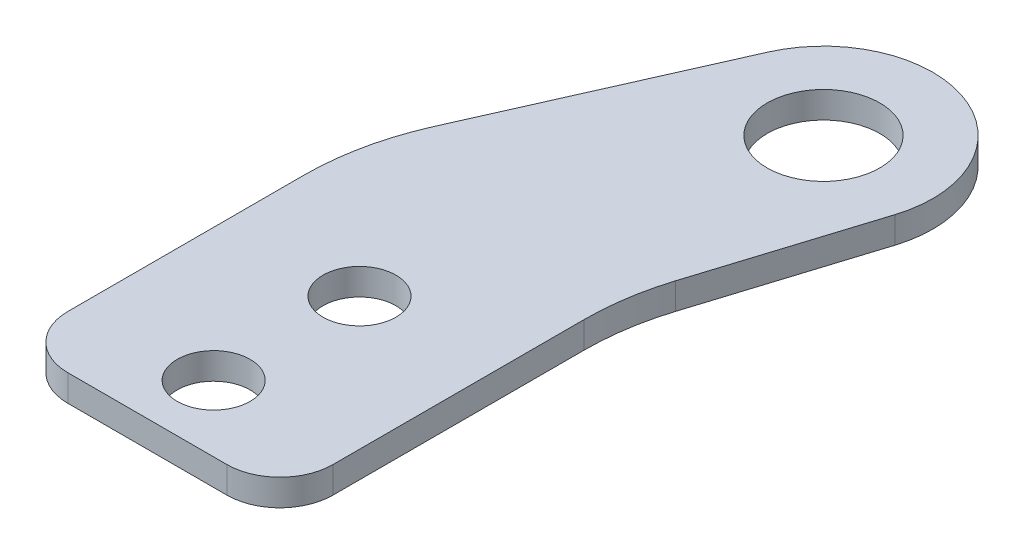
ISO-10303-21;
HEADER;
FILE_DESCRIPTION(('STEP AP214'),'2;1');
FILE_NAME('part.step','',(''),(''),'','','');
FILE_SCHEMA(('AUTOMOTIVE_DESIGN { 1 0 10303 214 1 1 1 1 }'));
ENDSEC;
DATA;
#1=APPLICATION_CONTEXT('core data for automotive mechanical design processes');
#2=APPLICATION_PROTOCOL_DEFINITION('international standard','automotive_design',2000,#1);
#3=PRODUCT_CONTEXT('',#1,'mechanical');
#4=PRODUCT('Part','Part','',(#3));
#5=PRODUCT_RELATED_PRODUCT_CATEGORY('part','',(#4));
#6=PRODUCT_DEFINITION_FORMATION('','',#4);
#7=PRODUCT_DEFINITION_CONTEXT('part definition',#1,'design');
#8=PRODUCT_DEFINITION('design','',#6,#7);
#9=PRODUCT_DEFINITION_SHAPE('','',#8);
#10=(LENGTH_UNIT() NAMED_UNIT(*) SI_UNIT(.MILLI.,.METRE.));
#11=(NAMED_UNIT(*) PLANE_ANGLE_UNIT() SI_UNIT($,.RADIAN.));
#12=(NAMED_UNIT(*) SI_UNIT($,.STERADIAN.) SOLID_ANGLE_UNIT());
#13=UNCERTAINTY_MEASURE_WITH_UNIT(LENGTH_MEASURE(1.E-05),#10,'distance_accuracy_value','');
#14=(GEOMETRIC_REPRESENTATION_CONTEXT(3) GLOBAL_UNCERTAINTY_ASSIGNED_CONTEXT((#13)) GLOBAL_UNIT_ASSIGNED_CONTEXT((#10,
#11,#12)) REPRESENTATION_CONTEXT('',''));
#15=CARTESIAN_POINT('',(0.,0.,0.));
#16=DIRECTION('',(0.,0.,1.));
#17=DIRECTION('',(1.,0.,0.));
#18=AXIS2_PLACEMENT_3D('',#15,#16,#17);
#19=CARTESIAN_POINT('',(-10.,-2.,0.));
#20=DIRECTION('',(-1.,0.,0.));
#21=DIRECTION('',(0.,0.,1.));
#22=AXIS2_PLACEMENT_3D('',#19,#20,#21);
#23=PLANE('',#22);
#24=DIRECTION('',(0.,0.,1.));
#25=VECTOR('',#24,1.);
#26=CARTESIAN_POINT('',(-10.,-2.,0.));
#27=LINE('',#26,#25);
#28=CARTESIAN_POINT('',(-10.,-2.,-21.767210757584));
#29=VERTEX_POINT('',#28);
#30=CARTESIAN_POINT('',(-10.,-2.,-4.));
#31=VERTEX_POINT('',#30);
#32=EDGE_CURVE('E156',#29,#31,#27,.T.);
#33=ORIENTED_EDGE('',*,*,#32,.T.);
#34=DIRECTION('',(0.,1.,0.));
#35=VECTOR('',#34,1.);
#36=CARTESIAN_POINT('',(-10.,-2.,-4.));
#37=LINE('',#36,#35);
#38=CARTESIAN_POINT('',(-10.,0.,-4.));
#39=VERTEX_POINT('',#38);
#40=EDGE_CURVE('E175',#31,#39,#37,.T.);
#41=ORIENTED_EDGE('',*,*,#40,.T.);
#42=DIRECTION('',(0.,0.,1.));
#43=VECTOR('',#42,1.);
#44=CARTESIAN_POINT('',(-10.,0.,0.));
#45=LINE('',#44,#43);
#46=CARTESIAN_POINT('',(-10.,0.,-21.767210757584));
#47=VERTEX_POINT('',#46);
#48=EDGE_CURVE('E141',#47,#39,#45,.T.);
#49=ORIENTED_EDGE('',*,*,#48,.F.);
#50=DIRECTION('',(0.,1.,0.));
#51=VECTOR('',#50,1.);
#52=CARTESIAN_POINT('',(-10.,-2.,-21.767210757584));
#53=LINE('',#52,#51);
#54=EDGE_CURVE('E163',#47,#29,#53,.F.);
#55=ORIENTED_EDGE('',*,*,#54,.T.);
#56=EDGE_LOOP('',(#33,#41,#49,#55));
#57=FACE_BOUND('',#56,.T.);
#58=ADVANCED_FACE('F35',(#57),#23,.T.);
#59=CARTESIAN_POINT('',(-10.,-2.,-26.));
#60=DIRECTION('',(-0.914257969875862,0.,-0.40513252710498));
#61=DIRECTION('',(-0.40513252710498,0.,0.914257969875862));
#62=AXIS2_PLACEMENT_3D('',#59,#60,#61);
#63=PLANE('',#62);
#64=DIRECTION('',(-0.40513252710498,0.,0.914257969875862));
#65=VECTOR('',#64,1.);
#66=CARTESIAN_POINT('',(-10.,-2.,-26.));
#67=LINE('',#66,#65);
#68=CARTESIAN_POINT('',(-0.542628251475869,-2.,-47.3423433486161));
#69=VERTEX_POINT('',#68);
#70=CARTESIAN_POINT('',(-8.28515939751724,-2.,-29.8698612996836));
#71=VERTEX_POINT('',#70);
#72=EDGE_CURVE('E133',#69,#71,#67,.T.);
#73=ORIENTED_EDGE('',*,*,#72,.T.);
#74=DIRECTION('',(0.,1.,0.));
#75=VECTOR('',#74,1.);
#76=CARTESIAN_POINT('',(-8.28515939751724,-2.,-29.8698612996836));
#77=LINE('',#76,#75);
#78=CARTESIAN_POINT('',(-8.28515939751724,0.,-29.8698612996836));
#79=VERTEX_POINT('',#78);
#80=EDGE_CURVE('E157',#71,#79,#77,.T.);
#81=ORIENTED_EDGE('',*,*,#80,.T.);
#82=DIRECTION('',(-0.40513252710498,0.,0.914257969875862));
#83=VECTOR('',#82,1.);
#84=CARTESIAN_POINT('',(-10.,0.,-26.));
#85=LINE('',#84,#83);
#86=CARTESIAN_POINT('',(-0.542628251475869,0.,-47.3423433486161));
#87=VERTEX_POINT('',#86);
#88=EDGE_CURVE('E153',#87,#79,#85,.T.);
#89=ORIENTED_EDGE('',*,*,#88,.F.);
#90=DIRECTION('',(0.,1.,0.));
#91=VECTOR('',#90,1.);
#92=CARTESIAN_POINT('',(-0.542628251475869,-2.,-47.3423433486161));
#93=LINE('',#92,#91);
#94=EDGE_CURVE('E132',#69,#87,#93,.T.);
#95=ORIENTED_EDGE('',*,*,#94,.F.);
#96=EDGE_LOOP('',(#73,#81,#89,#95));
#97=FACE_BOUND('',#96,.T.);
#98=ADVANCED_FACE('F214',(#97),#63,.T.);
#99=CARTESIAN_POINT('',(6.99999999999999,-2.,-44.));
#100=DIRECTION('',(0.,1.,0.));
#101=DIRECTION('',(0.,0.,1.));
#102=AXIS2_PLACEMENT_3D('',#99,#100,#101);
#103=CYLINDRICAL_SURFACE('',#102,8.25);
#104=CARTESIAN_POINT('',(6.99999999999999,0.,-44.));
#105=DIRECTION('',(0.,1.,0.));
#106=DIRECTION('',(0.,0.,-1.));
#107=AXIS2_PLACEMENT_3D('',#104,#105,#106);
#108=CIRCLE('',#107,8.25);
#109=CARTESIAN_POINT('',(14.8717936047529,0.,-41.5307156007921));
#110=VERTEX_POINT('',#109);
#111=EDGE_CURVE('E131',#110,#87,#108,.T.);
#112=ORIENTED_EDGE('',*,*,#111,.F.);
#113=DIRECTION('',(0.,1.,0.));
#114=VECTOR('',#113,1.);
#115=CARTESIAN_POINT('',(14.8717936047529,-2.,-41.5307156007921));
#116=LINE('',#115,#114);
#117=CARTESIAN_POINT('',(14.8717936047529,-2.,-41.5307156007921));
#118=VERTEX_POINT('',#117);
#119=EDGE_CURVE('E116',#118,#110,#116,.T.);
#120=ORIENTED_EDGE('',*,*,#119,.F.);
#121=CARTESIAN_POINT('',(6.99999999999999,-2.,-44.));
#122=DIRECTION('',(0.,1.,0.));
#123=DIRECTION('',(0.,0.,-1.));
#124=AXIS2_PLACEMENT_3D('',#121,#122,#123);
#125=CIRCLE('',#124,8.25);
#126=EDGE_CURVE('E123',#118,#69,#125,.T.);
#127=ORIENTED_EDGE('',*,*,#126,.T.);
#128=ORIENTED_EDGE('',*,*,#94,.T.);
#129=EDGE_LOOP('',(#112,#120,#127,#128));
#130=FACE_BOUND('',#129,.T.);
#131=ADVANCED_FACE('F128',(#130),#103,.T.);
#132=CARTESIAN_POINT('',(10.,-2.,-26.));
#133=DIRECTION('',(0.95415680057611,0.,0.299307199903982));
#134=DIRECTION('',(0.299307199903982,0.,-0.95415680057611));
#135=AXIS2_PLACEMENT_3D('',#132,#133,#134);
#136=PLANE('',#135);
#137=DIRECTION('',(0.299307199903982,0.,-0.95415680057611));
#138=VECTOR('',#137,1.);
#139=CARTESIAN_POINT('',(10.,0.,-26.));
#140=LINE('',#139,#138);
#141=CARTESIAN_POINT('',(10.9168639884778,0.,-28.9228565503606));
#142=VERTEX_POINT('',#141);
#143=EDGE_CURVE('E150',#142,#110,#140,.T.);
#144=ORIENTED_EDGE('',*,*,#143,.F.);
#145=DIRECTION('',(0.,1.,0.));
#146=VECTOR('',#145,1.);
#147=CARTESIAN_POINT('',(10.9168639884778,-2.,-28.9228565503606));
#148=LINE('',#147,#146);
#149=CARTESIAN_POINT('',(10.9168639884778,-2.,-28.9228565503606));
#150=VERTEX_POINT('',#149);
#151=EDGE_CURVE('E119',#142,#150,#148,.F.);
#152=ORIENTED_EDGE('',*,*,#151,.T.);
#153=DIRECTION('',(0.299307199903982,0.,-0.95415680057611));
#154=VECTOR('',#153,1.);
#155=CARTESIAN_POINT('',(10.,-2.,-26.));
#156=LINE('',#155,#154);
#157=EDGE_CURVE('E112',#150,#118,#156,.T.);
#158=ORIENTED_EDGE('',*,*,#157,.T.);
#159=ORIENTED_EDGE('',*,*,#119,.T.);
#160=EDGE_LOOP('',(#144,#152,#158,#159));
#161=FACE_BOUND('',#160,.T.);
#162=ADVANCED_FACE('F115',(#161),#136,.T.);
#163=CARTESIAN_POINT('',(10.,-2.,0.));
#164=DIRECTION('',(1.,0.,0.));
#165=DIRECTION('',(0.,0.,-1.));
#166=AXIS2_PLACEMENT_3D('',#163,#164,#165);
#167=PLANE('',#166);
#168=DIRECTION('',(0.,0.,-1.));
#169=VECTOR('',#168,1.);
#170=CARTESIAN_POINT('',(10.,0.,0.));
#171=LINE('',#170,#169);
#172=CARTESIAN_POINT('',(10.,0.,-4.));
#173=VERTEX_POINT('',#172);
#174=CARTESIAN_POINT('',(10.,0.,-22.9367125522809));
#175=VERTEX_POINT('',#174);
#176=EDGE_CURVE('E148',#173,#175,#171,.T.);
#177=ORIENTED_EDGE('',*,*,#176,.F.);
#178=DIRECTION('',(0.,1.,0.));
#179=VECTOR('',#178,1.);
#180=CARTESIAN_POINT('',(10.,-2.,-4.));
#181=LINE('',#180,#179);
#182=CARTESIAN_POINT('',(10.,-2.,-4.));
#183=VERTEX_POINT('',#182);
#184=EDGE_CURVE('E11',#173,#183,#181,.F.);
#185=ORIENTED_EDGE('',*,*,#184,.T.);
#186=DIRECTION('',(0.,0.,-1.));
#187=VECTOR('',#186,1.);
#188=CARTESIAN_POINT('',(10.,-2.,0.));
#189=LINE('',#188,#187);
#190=CARTESIAN_POINT('',(10.,-2.,-22.9367125522809));
#191=VERTEX_POINT('',#190);
#192=EDGE_CURVE('E124',#183,#191,#189,.T.);
#193=ORIENTED_EDGE('',*,*,#192,.T.);
#194=DIRECTION('',(0.,1.,0.));
#195=VECTOR('',#194,1.);
#196=CARTESIAN_POINT('',(10.,0.,-22.9367125522809));
#197=LINE('',#196,#195);
#198=EDGE_CURVE('E167',#191,#175,#197,.T.);
#199=ORIENTED_EDGE('',*,*,#198,.T.);
#200=EDGE_LOOP('',(#177,#185,#193,#199));
#201=FACE_BOUND('',#200,.T.);
#202=ADVANCED_FACE('F208',(#201),#167,.T.);
#203=CARTESIAN_POINT('',(-10.,-2.,0.));
#204=DIRECTION('',(0.,0.,1.));
#205=DIRECTION('',(1.,0.,0.));
#206=AXIS2_PLACEMENT_3D('',#203,#204,#205);
#207=PLANE('',#206);
#208=DIRECTION('',(1.,0.,0.));
#209=VECTOR('',#208,1.);
#210=CARTESIAN_POINT('',(-10.,0.,0.));
#211=LINE('',#210,#209);
#212=CARTESIAN_POINT('',(-6.,0.,0.));
#213=VERTEX_POINT('',#212);
#214=CARTESIAN_POINT('',(6.,0.,0.));
#215=VERTEX_POINT('',#214);
#216=EDGE_CURVE('E144',#213,#215,#211,.T.);
#217=ORIENTED_EDGE('',*,*,#216,.F.);
#218=DIRECTION('',(0.,1.,0.));
#219=VECTOR('',#218,1.);
#220=CARTESIAN_POINT('',(-6.,-2.,0.));
#221=LINE('',#220,#219);
#222=CARTESIAN_POINT('',(-6.,-2.,0.));
#223=VERTEX_POINT('',#222);
#224=EDGE_CURVE('E185',#213,#223,#221,.F.);
#225=ORIENTED_EDGE('',*,*,#224,.T.);
#226=DIRECTION('',(1.,0.,0.));
#227=VECTOR('',#226,1.);
#228=CARTESIAN_POINT('',(-10.,-2.,0.));
#229=LINE('',#228,#227);
#230=CARTESIAN_POINT('',(6.,-2.,0.));
#231=VERTEX_POINT('',#230);
#232=EDGE_CURVE('E191',#223,#231,#229,.T.);
#233=ORIENTED_EDGE('',*,*,#232,.T.);
#234=DIRECTION('',(0.,1.,0.));
#235=VECTOR('',#234,1.);
#236=CARTESIAN_POINT('',(6.,-2.,0.));
#237=LINE('',#236,#235);
#238=EDGE_CURVE('E182',#231,#215,#237,.T.);
#239=ORIENTED_EDGE('',*,*,#238,.T.);
#240=EDGE_LOOP('',(#217,#225,#233,#239));
#241=FACE_BOUND('',#240,.T.);
#242=ADVANCED_FACE('F204',(#241),#207,.T.);
#243=CARTESIAN_POINT('',(6.99999999999999,-2.,-44.));
#244=DIRECTION('',(0.,-1.,0.));
#245=DIRECTION('',(0.,0.,-1.));
#246=AXIS2_PLACEMENT_3D('',#243,#244,#245);
#247=PLANE('',#246);
#248=CARTESIAN_POINT('',(0.,-2.,-16.));
#249=DIRECTION('',(0.,1.,0.));
#250=DIRECTION('',(0.,0.,1.));
#251=AXIS2_PLACEMENT_3D('',#248,#249,#250);
#252=CIRCLE('',#251,2.75);
#253=CARTESIAN_POINT('',(0.,-2.,-13.25));
#254=VERTEX_POINT('',#253);
#255=EDGE_CURVE('E262',#254,#254,#252,.T.);
#256=ORIENTED_EDGE('',*,*,#255,.T.);
#257=EDGE_LOOP('',(#256));
#258=FACE_BOUND('',#257,.T.);
#259=CARTESIAN_POINT('',(0.,-2.,-5.));
#260=DIRECTION('',(0.,1.,0.));
#261=DIRECTION('',(0.,0.,1.));
#262=AXIS2_PLACEMENT_3D('',#259,#260,#261);
#263=CIRCLE('',#262,2.75);
#264=CARTESIAN_POINT('',(0.,-2.,-2.25));
#265=VERTEX_POINT('',#264);
#266=EDGE_CURVE('E272',#265,#265,#263,.T.);
#267=ORIENTED_EDGE('',*,*,#266,.T.);
#268=EDGE_LOOP('',(#267));
#269=FACE_BOUND('',#268,.T.);
#270=CARTESIAN_POINT('',(6.99999999999999,-2.,-44.));
#271=DIRECTION('',(0.,1.,0.));
#272=DIRECTION('',(0.,0.,1.));
#273=AXIS2_PLACEMENT_3D('',#270,#271,#272);
#274=CIRCLE('',#273,4.25);
#275=CARTESIAN_POINT('',(6.99999999999999,-2.,-39.75));
#276=VERTEX_POINT('',#275);
#277=EDGE_CURVE('E145',#276,#276,#274,.T.);
#278=ORIENTED_EDGE('',*,*,#277,.T.);
#279=EDGE_LOOP('',(#278));
#280=FACE_BOUND('',#279,.T.);
#281=ORIENTED_EDGE('',*,*,#232,.F.);
#282=CARTESIAN_POINT('',(-6.,-2.,-4.));
#283=DIRECTION('',(0.,-1.,0.));
#284=DIRECTION('',(0.,0.,-1.));
#285=AXIS2_PLACEMENT_3D('',#282,#283,#284);
#286=CIRCLE('',#285,4.);
#287=EDGE_CURVE('E43',#223,#31,#286,.T.);
#288=ORIENTED_EDGE('',*,*,#287,.T.);
#289=ORIENTED_EDGE('',*,*,#32,.F.);
#290=CARTESIAN_POINT('',(10.,-2.,-21.767210757584));
#291=DIRECTION('',(0.,-1.,0.));
#292=DIRECTION('',(0.,0.,-1.));
#293=AXIS2_PLACEMENT_3D('',#290,#291,#292);
#294=CIRCLE('',#293,20.);
#295=EDGE_CURVE('E165',#29,#71,#294,.T.);
#296=ORIENTED_EDGE('',*,*,#295,.T.);
#297=ORIENTED_EDGE('',*,*,#72,.F.);
#298=ORIENTED_EDGE('',*,*,#126,.F.);
#299=ORIENTED_EDGE('',*,*,#157,.F.);
#300=CARTESIAN_POINT('',(30.,-2.,-22.9367125522809));
#301=DIRECTION('',(0.,-1.,0.));
#302=DIRECTION('',(0.,0.,-1.));
#303=AXIS2_PLACEMENT_3D('',#300,#301,#302);
#304=CIRCLE('',#303,20.);
#305=EDGE_CURVE('E173',#150,#191,#304,.F.);
#306=ORIENTED_EDGE('',*,*,#305,.T.);
#307=ORIENTED_EDGE('',*,*,#192,.F.);
#308=CARTESIAN_POINT('',(6.,-2.,-4.));
#309=DIRECTION('',(0.,-1.,0.));
#310=DIRECTION('',(0.,0.,-1.));
#311=AXIS2_PLACEMENT_3D('',#308,#309,#310);
#312=CIRCLE('',#311,4.);
#313=EDGE_CURVE('E55',#183,#231,#312,.T.);
#314=ORIENTED_EDGE('',*,*,#313,.T.);
#315=EDGE_LOOP('',(#281,#288,#289,#296,#297,#298,#299,#306,#307,#314));
#316=FACE_BOUND('',#315,.T.);
#317=ADVANCED_FACE('F135',(#258,#269,#280,#316),#247,.T.);
#318=CARTESIAN_POINT('',(6.99999999999999,0.,-44.));
#319=DIRECTION('',(0.,-1.,0.));
#320=DIRECTION('',(0.,0.,-1.));
#321=AXIS2_PLACEMENT_3D('',#318,#319,#320);
#322=PLANE('',#321);
#323=CARTESIAN_POINT('',(0.,0.,-16.));
#324=DIRECTION('',(0.,1.,0.));
#325=DIRECTION('',(0.,0.,1.));
#326=AXIS2_PLACEMENT_3D('',#323,#324,#325);
#327=CIRCLE('',#326,2.75);
#328=CARTESIAN_POINT('',(0.,0.,-13.25));
#329=VERTEX_POINT('',#328);
#330=EDGE_CURVE('E265',#329,#329,#327,.T.);
#331=ORIENTED_EDGE('',*,*,#330,.F.);
#332=EDGE_LOOP('',(#331));
#333=FACE_BOUND('',#332,.T.);
#334=CARTESIAN_POINT('',(0.,0.,-5.));
#335=DIRECTION('',(0.,1.,0.));
#336=DIRECTION('',(0.,0.,1.));
#337=AXIS2_PLACEMENT_3D('',#334,#335,#336);
#338=CIRCLE('',#337,2.75);
#339=CARTESIAN_POINT('',(0.,0.,-2.25));
#340=VERTEX_POINT('',#339);
#341=EDGE_CURVE('E267',#340,#340,#338,.T.);
#342=ORIENTED_EDGE('',*,*,#341,.F.);
#343=EDGE_LOOP('',(#342));
#344=FACE_BOUND('',#343,.T.);
#345=CARTESIAN_POINT('',(6.99999999999999,0.,-44.));
#346=DIRECTION('',(0.,1.,0.));
#347=DIRECTION('',(0.,0.,1.));
#348=AXIS2_PLACEMENT_3D('',#345,#346,#347);
#349=CIRCLE('',#348,4.25);
#350=CARTESIAN_POINT('',(6.99999999999999,0.,-39.75));
#351=VERTEX_POINT('',#350);
#352=EDGE_CURVE('E275',#351,#351,#349,.T.);
#353=ORIENTED_EDGE('',*,*,#352,.F.);
#354=EDGE_LOOP('',(#353));
#355=FACE_BOUND('',#354,.T.);
#356=ORIENTED_EDGE('',*,*,#48,.T.);
#357=CARTESIAN_POINT('',(-6.,0.,-4.));
#358=DIRECTION('',(0.,-1.,0.));
#359=DIRECTION('',(0.,0.,-1.));
#360=AXIS2_PLACEMENT_3D('',#357,#358,#359);
#361=CIRCLE('',#360,4.);
#362=EDGE_CURVE('E180',#39,#213,#361,.F.);
#363=ORIENTED_EDGE('',*,*,#362,.T.);
#364=ORIENTED_EDGE('',*,*,#216,.T.);
#365=CARTESIAN_POINT('',(6.,0.,-4.));
#366=DIRECTION('',(0.,-1.,0.));
#367=DIRECTION('',(0.,0.,-1.));
#368=AXIS2_PLACEMENT_3D('',#365,#366,#367);
#369=CIRCLE('',#368,4.);
#370=EDGE_CURVE('E178',#215,#173,#369,.F.);
#371=ORIENTED_EDGE('',*,*,#370,.T.);
#372=ORIENTED_EDGE('',*,*,#176,.T.);
#373=CARTESIAN_POINT('',(30.,0.,-22.9367125522809));
#374=DIRECTION('',(0.,-1.,0.));
#375=DIRECTION('',(0.,0.,-1.));
#376=AXIS2_PLACEMENT_3D('',#373,#374,#375);
#377=CIRCLE('',#376,20.);
#378=EDGE_CURVE('E171',#175,#142,#377,.T.);
#379=ORIENTED_EDGE('',*,*,#378,.T.);
#380=ORIENTED_EDGE('',*,*,#143,.T.);
#381=ORIENTED_EDGE('',*,*,#111,.T.);
#382=ORIENTED_EDGE('',*,*,#88,.T.);
#383=CARTESIAN_POINT('',(10.,0.,-21.767210757584));
#384=DIRECTION('',(0.,-1.,0.));
#385=DIRECTION('',(0.,0.,-1.));
#386=AXIS2_PLACEMENT_3D('',#383,#384,#385);
#387=CIRCLE('',#386,20.);
#388=EDGE_CURVE('E161',#79,#47,#387,.F.);
#389=ORIENTED_EDGE('',*,*,#388,.T.);
#390=EDGE_LOOP('',(#356,#363,#364,#371,#372,#379,#380,#381,#382,#389));
#391=FACE_BOUND('',#390,.T.);
#392=ADVANCED_FACE('F202',(#333,#344,#355,#391),#322,.F.);
#393=CARTESIAN_POINT('',(6.99999999999999,-2.,-44.));
#394=DIRECTION('',(0.,1.,0.));
#395=DIRECTION('',(0.,0.,1.));
#396=AXIS2_PLACEMENT_3D('',#393,#394,#395);
#397=CYLINDRICAL_SURFACE('',#396,4.25);
#398=ORIENTED_EDGE('',*,*,#277,.F.);
#399=EDGE_LOOP('',(#398));
#400=FACE_BOUND('',#399,.T.);
#401=ORIENTED_EDGE('',*,*,#352,.T.);
#402=EDGE_LOOP('',(#401));
#403=FACE_BOUND('',#402,.T.);
#404=ADVANCED_FACE('F219',(#400,#403),#397,.F.);
#405=CARTESIAN_POINT('',(10.,-2.,-21.767210757584));
#406=DIRECTION('',(0.,1.,0.));
#407=DIRECTION('',(0.,0.,1.));
#408=AXIS2_PLACEMENT_3D('',#405,#406,#407);
#409=CYLINDRICAL_SURFACE('',#408,20.);
#410=ORIENTED_EDGE('',*,*,#295,.F.);
#411=ORIENTED_EDGE('',*,*,#54,.F.);
#412=ORIENTED_EDGE('',*,*,#388,.F.);
#413=ORIENTED_EDGE('',*,*,#80,.F.);
#414=EDGE_LOOP('',(#410,#411,#412,#413));
#415=FACE_BOUND('',#414,.T.);
#416=ADVANCED_FACE('F217',(#415),#409,.T.);
#417=CARTESIAN_POINT('',(30.,-2.,-22.9367125522809));
#418=DIRECTION('',(0.,-1.,0.));
#419=DIRECTION('',(0.,0.,-1.));
#420=AXIS2_PLACEMENT_3D('',#417,#418,#419);
#421=CYLINDRICAL_SURFACE('',#420,20.);
#422=ORIENTED_EDGE('',*,*,#305,.F.);
#423=ORIENTED_EDGE('',*,*,#151,.F.);
#424=ORIENTED_EDGE('',*,*,#378,.F.);
#425=ORIENTED_EDGE('',*,*,#198,.F.);
#426=EDGE_LOOP('',(#422,#423,#424,#425));
#427=FACE_BOUND('',#426,.T.);
#428=ADVANCED_FACE('F211',(#427),#421,.F.);
#429=CARTESIAN_POINT('',(0.,0.,-5.));
#430=DIRECTION('',(0.,1.,0.));
#431=DIRECTION('',(0.,0.,1.));
#432=AXIS2_PLACEMENT_3D('',#429,#430,#431);
#433=CYLINDRICAL_SURFACE('',#432,2.75);
#434=ORIENTED_EDGE('',*,*,#266,.F.);
#435=EDGE_LOOP('',(#434));
#436=FACE_BOUND('',#435,.T.);
#437=ORIENTED_EDGE('',*,*,#341,.T.);
#438=EDGE_LOOP('',(#437));
#439=FACE_BOUND('',#438,.T.);
#440=ADVANCED_FACE('F225',(#436,#439),#433,.F.);
#441=CARTESIAN_POINT('',(0.,0.,-16.));
#442=DIRECTION('',(0.,1.,0.));
#443=DIRECTION('',(0.,0.,1.));
#444=AXIS2_PLACEMENT_3D('',#441,#442,#443);
#445=CYLINDRICAL_SURFACE('',#444,2.75);
#446=ORIENTED_EDGE('',*,*,#255,.F.);
#447=EDGE_LOOP('',(#446));
#448=FACE_BOUND('',#447,.T.);
#449=ORIENTED_EDGE('',*,*,#330,.T.);
#450=EDGE_LOOP('',(#449));
#451=FACE_BOUND('',#450,.T.);
#452=ADVANCED_FACE('F252',(#448,#451),#445,.F.);
#453=CARTESIAN_POINT('',(-6.,-2.,-4.));
#454=DIRECTION('',(0.,1.,0.));
#455=DIRECTION('',(0.,0.,1.));
#456=AXIS2_PLACEMENT_3D('',#453,#454,#455);
#457=CYLINDRICAL_SURFACE('',#456,4.);
#458=ORIENTED_EDGE('',*,*,#287,.F.);
#459=ORIENTED_EDGE('',*,*,#224,.F.);
#460=ORIENTED_EDGE('',*,*,#362,.F.);
#461=ORIENTED_EDGE('',*,*,#40,.F.);
#462=EDGE_LOOP('',(#458,#459,#460,#461));
#463=FACE_BOUND('',#462,.T.);
#464=ADVANCED_FACE('F199',(#463),#457,.T.);
#465=CARTESIAN_POINT('',(6.,-2.,-4.));
#466=DIRECTION('',(0.,1.,0.));
#467=DIRECTION('',(0.,0.,1.));
#468=AXIS2_PLACEMENT_3D('',#465,#466,#467);
#469=CYLINDRICAL_SURFACE('',#468,4.);
#470=ORIENTED_EDGE('',*,*,#313,.F.);
#471=ORIENTED_EDGE('',*,*,#184,.F.);
#472=ORIENTED_EDGE('',*,*,#370,.F.);
#473=ORIENTED_EDGE('',*,*,#238,.F.);
#474=EDGE_LOOP('',(#470,#471,#472,#473));
#475=FACE_BOUND('',#474,.T.);
#476=ADVANCED_FACE('F37',(#475),#469,.T.);
#477=CLOSED_SHELL('',(#58,#98,#131,#162,#202,#242,#317,#392,#404,#416,#428,#440,#452,#464,#476));
#478=MANIFOLD_SOLID_BREP('B2',#477);
#479=ADVANCED_BREP_SHAPE_REPRESENTATION('',(#18,#478),#14);
#480=SHAPE_DEFINITION_REPRESENTATION(#9,#479);
ENDSEC;
END-ISO-10303-21;
